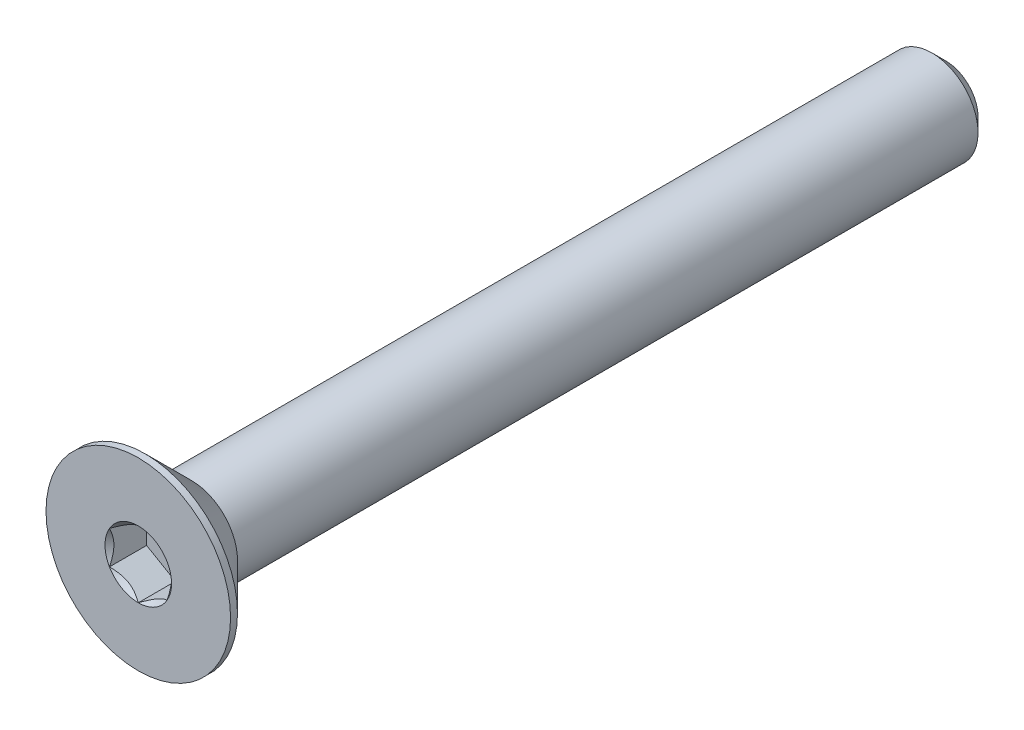
ISO-10303-21;
HEADER;
FILE_DESCRIPTION(('STEP AP214'),'2;1');
FILE_NAME('part.step','',(''),(''),'','','');
FILE_SCHEMA(('AUTOMOTIVE_DESIGN { 1 0 10303 214 1 1 1 1 }'));
ENDSEC;
DATA;
#1=APPLICATION_CONTEXT('core data for automotive mechanical design processes');
#2=APPLICATION_PROTOCOL_DEFINITION('international standard','automotive_design',2000,#1);
#3=PRODUCT_CONTEXT('',#1,'mechanical');
#4=PRODUCT('Part','Part','',(#3));
#5=PRODUCT_RELATED_PRODUCT_CATEGORY('part','',(#4));
#6=PRODUCT_DEFINITION_FORMATION('','',#4);
#7=PRODUCT_DEFINITION_CONTEXT('part definition',#1,'design');
#8=PRODUCT_DEFINITION('design','',#6,#7);
#9=PRODUCT_DEFINITION_SHAPE('','',#8);
#10=(LENGTH_UNIT() NAMED_UNIT(*) SI_UNIT(.MILLI.,.METRE.));
#11=(NAMED_UNIT(*) PLANE_ANGLE_UNIT() SI_UNIT($,.RADIAN.));
#12=(NAMED_UNIT(*) SI_UNIT($,.STERADIAN.) SOLID_ANGLE_UNIT());
#13=UNCERTAINTY_MEASURE_WITH_UNIT(LENGTH_MEASURE(1.E-05),#10,'distance_accuracy_value','');
#14=(GEOMETRIC_REPRESENTATION_CONTEXT(3) GLOBAL_UNCERTAINTY_ASSIGNED_CONTEXT((#13)) GLOBAL_UNIT_ASSIGNED_CONTEXT((#10,
#11,#12)) REPRESENTATION_CONTEXT('',''));
#15=CARTESIAN_POINT('',(0.,0.,0.));
#16=DIRECTION('',(0.,0.,1.));
#17=DIRECTION('',(1.,0.,0.));
#18=AXIS2_PLACEMENT_3D('',#15,#16,#17);
#19=CARTESIAN_POINT('',(0.,0.,-17.5));
#20=DIRECTION('',(0.,0.,-1.));
#21=DIRECTION('',(0.,1.,0.));
#22=AXIS2_PLACEMENT_3D('',#19,#20,#21);
#23=CYLINDRICAL_SURFACE('',#22,2.);
#24=CARTESIAN_POINT('',(0.,0.,15.2));
#25=DIRECTION('',(0.,0.,-1.));
#26=DIRECTION('',(0.,1.,0.));
#27=AXIS2_PLACEMENT_3D('',#24,#25,#26);
#28=CIRCLE('',#27,2.);
#29=CARTESIAN_POINT('',(0.,2.,15.2));
#30=VERTEX_POINT('',#29);
#31=EDGE_CURVE('E11',#30,#30,#28,.F.);
#32=ORIENTED_EDGE('',*,*,#31,.F.);
#33=EDGE_LOOP('',(#32));
#34=FACE_BOUND('',#33,.T.);
#35=CARTESIAN_POINT('',(0.,0.,-16.9));
#36=DIRECTION('',(0.,0.,-1.));
#37=DIRECTION('',(0.,1.,0.));
#38=AXIS2_PLACEMENT_3D('',#35,#36,#37);
#39=CIRCLE('',#38,2.);
#40=CARTESIAN_POINT('',(0.,2.,-16.9));
#41=VERTEX_POINT('',#40);
#42=EDGE_CURVE('E45',#41,#41,#39,.F.);
#43=ORIENTED_EDGE('',*,*,#42,.T.);
#44=EDGE_LOOP('',(#43));
#45=FACE_BOUND('',#44,.T.);
#46=ADVANCED_FACE('F37',(#34,#45),#23,.T.);
#47=CARTESIAN_POINT('',(0.,2.,-17.5));
#48=DIRECTION('',(0.,0.,-1.));
#49=DIRECTION('',(0.,1.,0.));
#50=AXIS2_PLACEMENT_3D('',#47,#48,#49);
#51=PLANE('',#50);
#52=CARTESIAN_POINT('',(0.,0.,-17.5));
#53=DIRECTION('',(0.,0.,-1.));
#54=DIRECTION('',(0.,1.,0.));
#55=AXIS2_PLACEMENT_3D('',#52,#53,#54);
#56=CIRCLE('',#55,1.40000000000001);
#57=CARTESIAN_POINT('',(0.,1.40000000000001,-17.5));
#58=VERTEX_POINT('',#57);
#59=EDGE_CURVE('E149',#58,#58,#56,.T.);
#60=ORIENTED_EDGE('',*,*,#59,.T.);
#61=EDGE_LOOP('',(#60));
#62=FACE_BOUND('',#61,.T.);
#63=ADVANCED_FACE('F158',(#62),#51,.T.);
#64=CARTESIAN_POINT('',(0.,0.,-17.5));
#65=DIRECTION('',(0.,0.,1.));
#66=DIRECTION('',(0.,-1.,0.));
#67=AXIS2_PLACEMENT_3D('',#64,#65,#66);
#68=CONICAL_SURFACE('',#67,1.40000000000001,0.785398163397446);
#69=ORIENTED_EDGE('',*,*,#42,.F.);
#70=EDGE_LOOP('',(#69));
#71=FACE_BOUND('',#70,.T.);
#72=ORIENTED_EDGE('',*,*,#59,.F.);
#73=EDGE_LOOP('',(#72));
#74=FACE_BOUND('',#73,.T.);
#75=ADVANCED_FACE('F39',(#71,#74),#68,.T.);
#76=CARTESIAN_POINT('',(0.,0.,-17.5));
#77=DIRECTION('',(0.,0.,-1.));
#78=DIRECTION('',(0.,1.,0.));
#79=AXIS2_PLACEMENT_3D('',#76,#77,#78);
#80=CYLINDRICAL_SURFACE('',#79,4.);
#81=CARTESIAN_POINT('',(0.,0.,17.5));
#82=DIRECTION('',(0.,0.,-1.));
#83=DIRECTION('',(0.,1.,0.));
#84=AXIS2_PLACEMENT_3D('',#81,#82,#83);
#85=CIRCLE('',#84,4.);
#86=CARTESIAN_POINT('',(0.,4.,17.5));
#87=VERTEX_POINT('',#86);
#88=EDGE_CURVE('E129',#87,#87,#85,.T.);
#89=ORIENTED_EDGE('',*,*,#88,.T.);
#90=EDGE_LOOP('',(#89));
#91=FACE_BOUND('',#90,.T.);
#92=CARTESIAN_POINT('',(0.,0.,17.2));
#93=DIRECTION('',(0.,0.,-1.));
#94=DIRECTION('',(0.,1.,0.));
#95=AXIS2_PLACEMENT_3D('',#92,#93,#94);
#96=CIRCLE('',#95,4.);
#97=CARTESIAN_POINT('',(0.,4.,17.2));
#98=VERTEX_POINT('',#97);
#99=EDGE_CURVE('E126',#98,#98,#96,.T.);
#100=ORIENTED_EDGE('',*,*,#99,.F.);
#101=EDGE_LOOP('',(#100));
#102=FACE_BOUND('',#101,.T.);
#103=ADVANCED_FACE('F157',(#91,#102),#80,.T.);
#104=CARTESIAN_POINT('',(0.,0.,15.2));
#105=DIRECTION('',(0.,0.,1.));
#106=DIRECTION('',(0.,-1.,0.));
#107=AXIS2_PLACEMENT_3D('',#104,#105,#106);
#108=CONICAL_SURFACE('',#107,2.,0.785398163397451);
#109=ORIENTED_EDGE('',*,*,#99,.T.);
#110=EDGE_LOOP('',(#109));
#111=FACE_BOUND('',#110,.T.);
#112=ORIENTED_EDGE('',*,*,#31,.T.);
#113=EDGE_LOOP('',(#112));
#114=FACE_BOUND('',#113,.T.);
#115=ADVANCED_FACE('F171',(#111,#114),#108,.T.);
#116=CARTESIAN_POINT('',(0.,0.,17.5));
#117=DIRECTION('',(0.,0.,1.));
#118=DIRECTION('',(0.,-1.,0.));
#119=AXIS2_PLACEMENT_3D('',#116,#117,#118);
#120=PLANE('',#119);
#121=CARTESIAN_POINT('',(0.,0.,17.5));
#122=DIRECTION('',(0.,0.,1.));
#123=DIRECTION('',(1.,0.,0.));
#124=AXIS2_PLACEMENT_3D('',#121,#122,#123);
#125=CIRCLE('',#124,1.44337567297406);
#126=CARTESIAN_POINT('',(1.25,0.721687836487035,17.5));
#127=VERTEX_POINT('',#126);
#128=CARTESIAN_POINT('',(0.,1.44337567297407,17.5));
#129=VERTEX_POINT('',#128);
#130=EDGE_CURVE('E96',#127,#129,#125,.T.);
#131=ORIENTED_EDGE('',*,*,#130,.F.);
#132=CARTESIAN_POINT('',(0.,0.,17.5));
#133=DIRECTION('',(0.,0.,1.));
#134=DIRECTION('',(1.,0.,0.));
#135=AXIS2_PLACEMENT_3D('',#132,#133,#134);
#136=CIRCLE('',#135,1.44337567297406);
#137=CARTESIAN_POINT('',(1.24999999999999,-0.721687836487039,17.5));
#138=VERTEX_POINT('',#137);
#139=EDGE_CURVE('E108',#138,#127,#136,.T.);
#140=ORIENTED_EDGE('',*,*,#139,.F.);
#141=CARTESIAN_POINT('',(0.,0.,17.5));
#142=DIRECTION('',(0.,0.,1.));
#143=DIRECTION('',(1.,0.,0.));
#144=AXIS2_PLACEMENT_3D('',#141,#142,#143);
#145=CIRCLE('',#144,1.44337567297406);
#146=CARTESIAN_POINT('',(0.,-1.44337567297406,17.5));
#147=VERTEX_POINT('',#146);
#148=EDGE_CURVE('E242',#147,#138,#145,.T.);
#149=ORIENTED_EDGE('',*,*,#148,.F.);
#150=CARTESIAN_POINT('',(0.,0.,17.5));
#151=DIRECTION('',(0.,0.,1.));
#152=DIRECTION('',(1.,0.,0.));
#153=AXIS2_PLACEMENT_3D('',#150,#151,#152);
#154=CIRCLE('',#153,1.44337567297406);
#155=CARTESIAN_POINT('',(-1.25,-0.72168783648702,17.5));
#156=VERTEX_POINT('',#155);
#157=EDGE_CURVE('E121',#156,#147,#154,.T.);
#158=ORIENTED_EDGE('',*,*,#157,.F.);
#159=CARTESIAN_POINT('',(0.,0.,17.5));
#160=DIRECTION('',(0.,0.,1.));
#161=DIRECTION('',(1.,0.,0.));
#162=AXIS2_PLACEMENT_3D('',#159,#160,#161);
#163=CIRCLE('',#162,1.44337567297406);
#164=CARTESIAN_POINT('',(-1.25,0.721687836487032,17.5));
#165=VERTEX_POINT('',#164);
#166=EDGE_CURVE('E243',#165,#156,#163,.T.);
#167=ORIENTED_EDGE('',*,*,#166,.F.);
#168=CARTESIAN_POINT('',(0.,0.,17.5));
#169=DIRECTION('',(0.,0.,1.));
#170=DIRECTION('',(1.,0.,0.));
#171=AXIS2_PLACEMENT_3D('',#168,#169,#170);
#172=CIRCLE('',#171,1.44337567297406);
#173=EDGE_CURVE('E111',#129,#165,#172,.T.);
#174=ORIENTED_EDGE('',*,*,#173,.F.);
#175=EDGE_LOOP('',(#131,#140,#149,#158,#167,#174));
#176=FACE_BOUND('',#175,.T.);
#177=ORIENTED_EDGE('',*,*,#88,.F.);
#178=EDGE_LOOP('',(#177));
#179=FACE_BOUND('',#178,.T.);
#180=ADVANCED_FACE('F105',(#176,#179),#120,.T.);
#181=CARTESIAN_POINT('',(1.25,0.721687836487033,15.89));
#182=DIRECTION('',(0.5,0.866025403784439,0.));
#183=DIRECTION('',(-0.866025403784439,0.5,0.));
#184=AXIS2_PLACEMENT_3D('',#181,#182,#183);
#185=PLANE('',#184);
#186=DIRECTION('',(0.,0.,1.));
#187=VECTOR('',#186,1.);
#188=CARTESIAN_POINT('',(1.25,0.721687836487033,15.89));
#189=LINE('',#188,#187);
#190=CARTESIAN_POINT('',(1.25,0.721687836487033,15.89));
#191=VERTEX_POINT('',#190);
#192=EDGE_CURVE('E52',#191,#127,#189,.T.);
#193=ORIENTED_EDGE('',*,*,#192,.T.);
#194=CARTESIAN_POINT('',(-0.000200000000000177,1.4434911430279,17.5001154839091));
#195=CARTESIAN_POINT('',(0.0427751670715862,1.41867941875065,17.4753216680551));
#196=CARTESIAN_POINT('',(0.0864690047459467,1.39345276980743,17.4519837344187));
#197=CARTESIAN_POINT('',(0.175565930841939,1.34201263554194,17.4092520040845));
#198=CARTESIAN_POINT('',(0.220977498357061,1.31579425481277,17.3898819923604));
#199=CARTESIAN_POINT('',(0.312547820935256,1.26292610442246,17.3567004834135));
#200=CARTESIAN_POINT('',(0.358683240175881,1.23628980770471,17.3428055590527));
#201=CARTESIAN_POINT('',(0.451970080407587,1.18243062538509,17.3213972821606));
#202=CARTESIAN_POINT('',(0.499118649136374,1.15520938653762,17.3138679415668));
#203=CARTESIAN_POINT('',(0.580373556887245,1.10829684367467,17.3070744980507));
#204=CARTESIAN_POINT('',(0.614374876627934,1.08866617256958,17.3060685591044));
#205=CARTESIAN_POINT('',(0.68231776443247,1.04943932800611,17.3077614149113));
#206=CARTESIAN_POINT('',(0.71625931765565,1.029843163116,17.3104610272155));
#207=CARTESIAN_POINT('',(0.783814856457491,0.990839954603505,17.3194089303164));
#208=CARTESIAN_POINT('',(0.817428507286766,0.971433104248777,17.3256605258997));
#209=CARTESIAN_POINT('',(0.884094638217804,0.932943395609911,17.3413756814139));
#210=CARTESIAN_POINT('',(0.917146871030287,0.913860680098306,17.3508406200875));
#211=CARTESIAN_POINT('',(1.00179969160026,0.864986351354573,17.3789313906876));
#212=CARTESIAN_POINT('',(1.05286649242963,0.83550292014908,17.3996701574522));
#213=CARTESIAN_POINT('',(1.15300085411325,0.777690319475911,17.4463871346715));
#214=CARTESIAN_POINT('',(1.20207431157827,0.749357745598419,17.4723482959468));
#215=CARTESIAN_POINT('',(1.2502,0.721572366433195,17.5001154839091));
#216=B_SPLINE_CURVE_WITH_KNOTS('',3,(#194,#195,#196,#197,#198,#199,#200,#201,#202,#203,#204,
#205,#206,#207,#208,#209,#210,#211,#212,#213,#214,#215),.UNSPECIFIED.,.F.,.F.,(4,2,2,2,2,2,2,2,
2,2,4),(0.,0.166533409618302,0.334037607289759,0.498880396489693,0.663307919240267,
0.780963963458819,0.898645970148444,1.01643764860772,1.13427993171548,1.3214865203214,
1.50809158792574),.UNSPECIFIED.);
#217=EDGE_CURVE('E93',#129,#127,#216,.T.);
#218=ORIENTED_EDGE('',*,*,#217,.F.);
#219=DIRECTION('',(0.,0.,1.));
#220=VECTOR('',#219,1.);
#221=CARTESIAN_POINT('',(0.,1.44337567297406,15.89));
#222=LINE('',#221,#220);
#223=CARTESIAN_POINT('',(0.,1.44337567297406,15.89));
#224=VERTEX_POINT('',#223);
#225=EDGE_CURVE('E145',#224,#129,#222,.T.);
#226=ORIENTED_EDGE('',*,*,#225,.F.);
#227=DIRECTION('',(-0.866025403784439,0.5,0.));
#228=VECTOR('',#227,1.);
#229=CARTESIAN_POINT('',(1.25,0.721687836487033,15.89));
#230=LINE('',#229,#228);
#231=EDGE_CURVE('E118',#191,#224,#230,.T.);
#232=ORIENTED_EDGE('',*,*,#231,.F.);
#233=EDGE_LOOP('',(#193,#218,#226,#232));
#234=FACE_BOUND('',#233,.T.);
#235=ADVANCED_FACE('F123',(#234),#185,.F.);
#236=CARTESIAN_POINT('',(1.25,-0.721687836487033,15.89));
#237=DIRECTION('',(1.,0.,0.));
#238=DIRECTION('',(0.,1.,0.));
#239=AXIS2_PLACEMENT_3D('',#236,#237,#238);
#240=PLANE('',#239);
#241=DIRECTION('',(0.,0.,1.));
#242=VECTOR('',#241,1.);
#243=CARTESIAN_POINT('',(1.25,-0.721687836487033,15.89));
#244=LINE('',#243,#242);
#245=CARTESIAN_POINT('',(1.25,-0.721687836487033,15.89));
#246=VERTEX_POINT('',#245);
#247=EDGE_CURVE('E60',#246,#138,#244,.T.);
#248=ORIENTED_EDGE('',*,*,#247,.T.);
#249=CARTESIAN_POINT('',(1.25,-1.43934010808078,17.9629820968923));
#250=CARTESIAN_POINT('',(1.25,-1.40429313005659,17.9365249226329));
#251=CARTESIAN_POINT('',(1.25,-1.369050871356,17.9103271603543));
#252=CARTESIAN_POINT('',(1.25,-1.29809650706311,17.8585575718396));
#253=CARTESIAN_POINT('',(1.25,-1.26238428576496,17.8329859043563));
#254=CARTESIAN_POINT('',(1.25,-1.15390111792708,17.7570059936895));
#255=CARTESIAN_POINT('',(1.25,-1.08031646726265,17.7077402861896));
#256=CARTESIAN_POINT('',(1.25,-0.926012322755098,17.6110258302631));
#257=CARTESIAN_POINT('',(1.25,-0.84512531865615,17.5638412989418));
#258=CARTESIAN_POINT('',(1.25,-0.679311174076605,17.4775307343904));
#259=CARTESIAN_POINT('',(1.25,-0.594398891026688,17.4383775346269));
#260=CARTESIAN_POINT('',(1.25,-0.466944812460739,17.3904772236883));
#261=CARTESIAN_POINT('',(1.25,-0.426289985812821,17.3767294897863));
#262=CARTESIAN_POINT('',(1.25,-0.343998850091266,17.3524979274505));
#263=CARTESIAN_POINT('',(1.25,-0.30236247361496,17.3420143238698));
#264=CARTESIAN_POINT('',(1.25,-0.219052696285662,17.3250301617483));
#265=CARTESIAN_POINT('',(1.25,-0.177393428474496,17.3184613604714));
#266=CARTESIAN_POINT('',(1.25,-0.0936293693401864,17.3094350534578));
#267=CARTESIAN_POINT('',(1.25,-0.0515246558543897,17.3069768409973));
#268=CARTESIAN_POINT('',(1.25,0.0311890576306386,17.3063540620133));
#269=CARTESIAN_POINT('',(1.25,0.0717969625499375,17.3080371168463));
#270=CARTESIAN_POINT('',(1.25,0.152668636885204,17.3152682705979));
#271=CARTESIAN_POINT('',(1.25,0.192932338835365,17.3208171104131));
#272=CARTESIAN_POINT('',(1.25,0.273499879165302,17.335571036465));
#273=CARTESIAN_POINT('',(1.25,0.313792180618518,17.3448381759641));
#274=CARTESIAN_POINT('',(1.25,0.393496413911464,17.3665361784574));
#275=CARTESIAN_POINT('',(1.25,0.432908419115066,17.3789667767306));
#276=CARTESIAN_POINT('',(1.25,0.556992735862305,17.4227793529314));
#277=CARTESIAN_POINT('',(1.25,0.639898924666093,17.459151072876));
#278=CARTESIAN_POINT('',(1.25,0.80181655549971,17.5400191621783));
#279=CARTESIAN_POINT('',(1.25,0.880812666325053,17.584544720912));
#280=CARTESIAN_POINT('',(1.25,1.03178561279751,17.6764048766666));
#281=CARTESIAN_POINT('',(1.25,1.10391618485086,17.7234899339163));
#282=CARTESIAN_POINT('',(1.25,1.21018606043311,17.7962785615985));
#283=CARTESIAN_POINT('',(1.25,1.2451506996938,17.8207980853934));
#284=CARTESIAN_POINT('',(1.25,1.31460220852737,17.8704856367657));
#285=CARTESIAN_POINT('',(1.25,1.34908920596619,17.8956534854155));
#286=CARTESIAN_POINT('',(1.25,1.38337731682912,17.9210901488412));
#287=B_SPLINE_CURVE_WITH_KNOTS('',3,(#249,#250,#251,#252,#253,#254,#255,#256,#257,#258,#259,
#260,#261,#262,#263,#264,#265,#266,#267,#268,#269,#270,#271,#272,#273,#274,#275,#276,#277,#278,
#279,#280,#281,#282,#283,#284,#285,#286),.UNSPECIFIED.,.F.,.F.,(4,2,2,2,2,2,2,2,2,2,2,2,2,2,2,2,
2,2,4),(0.,0.131732960381449,0.263498984161648,0.529042014455828,0.809741926134624,
1.08947609717226,1.21811634272578,1.34676544783902,1.47310084517845,1.59941451973786,
1.72115042167851,1.84290966131736,1.96679153905343,2.09066305366041,2.36146692896011,
2.63325989198493,2.89154668212281,3.01965734507715,3.1477330224563),.UNSPECIFIED.);
#288=EDGE_CURVE('E117',#127,#138,#287,.F.);
#289=ORIENTED_EDGE('',*,*,#288,.F.);
#290=ORIENTED_EDGE('',*,*,#192,.F.);
#291=DIRECTION('',(0.,1.,0.));
#292=VECTOR('',#291,1.);
#293=CARTESIAN_POINT('',(1.25,-0.721687836487033,15.89));
#294=LINE('',#293,#292);
#295=EDGE_CURVE('E134',#246,#191,#294,.T.);
#296=ORIENTED_EDGE('',*,*,#295,.F.);
#297=EDGE_LOOP('',(#248,#289,#290,#296));
#298=FACE_BOUND('',#297,.T.);
#299=ADVANCED_FACE('F120',(#298),#240,.F.);
#300=CARTESIAN_POINT('',(0.,-1.44337567297406,15.89));
#301=DIRECTION('',(0.5,-0.866025403784439,0.));
#302=DIRECTION('',(0.866025403784439,0.5,0.));
#303=AXIS2_PLACEMENT_3D('',#300,#301,#302);
#304=PLANE('',#303);
#305=DIRECTION('',(0.,0.,1.));
#306=VECTOR('',#305,1.);
#307=CARTESIAN_POINT('',(0.,-1.44337567297406,15.89));
#308=LINE('',#307,#306);
#309=CARTESIAN_POINT('',(0.,-1.44337567297406,15.89));
#310=VERTEX_POINT('',#309);
#311=EDGE_CURVE('E131',#310,#147,#308,.T.);
#312=ORIENTED_EDGE('',*,*,#311,.T.);
#313=CARTESIAN_POINT('',(1.2502,-0.721572366433196,17.5001154839091));
#314=CARTESIAN_POINT('',(1.20722483292841,-0.746384090710445,17.4753216680551));
#315=CARTESIAN_POINT('',(1.16353099525405,-0.771610739653665,17.4519837344187));
#316=CARTESIAN_POINT('',(1.07443406915806,-0.823050873919155,17.4092520040845));
#317=CARTESIAN_POINT('',(1.02902250164294,-0.849269254648333,17.3898819923604));
#318=CARTESIAN_POINT('',(0.937452179064743,-0.902137405038635,17.3567004834135));
#319=CARTESIAN_POINT('',(0.891316759824117,-0.928773701756386,17.3428055590527));
#320=CARTESIAN_POINT('',(0.798029919592411,-0.982632884076011,17.3213972821606));
#321=CARTESIAN_POINT('',(0.750881350863624,-1.00985412292348,17.3138679415668));
#322=CARTESIAN_POINT('',(0.669626443112752,-1.05676666578643,17.3070744980507));
#323=CARTESIAN_POINT('',(0.635625123372063,-1.07639733689152,17.3060685591044));
#324=CARTESIAN_POINT('',(0.567682235567526,-1.11562418145499,17.3077614149113));
#325=CARTESIAN_POINT('',(0.533740682344346,-1.1352203463451,17.3104610272155));
#326=CARTESIAN_POINT('',(0.466185143542504,-1.1742235548576,17.3194089303164));
#327=CARTESIAN_POINT('',(0.432571492713228,-1.19363040521232,17.3256605258997));
#328=CARTESIAN_POINT('',(0.36590536178219,-1.23212011385119,17.3413756814139));
#329=CARTESIAN_POINT('',(0.332853128969707,-1.2512028293628,17.3508406200875));
#330=CARTESIAN_POINT('',(0.248200308399738,-1.30007715810653,17.3789313906876));
#331=CARTESIAN_POINT('',(0.197133507570363,-1.32956058931202,17.3996701574522));
#332=CARTESIAN_POINT('',(0.0969991458867458,-1.38737318998519,17.4463871346715));
#333=CARTESIAN_POINT('',(0.0479256884217306,-1.41570576386268,17.4723482959468));
#334=CARTESIAN_POINT('',(-0.000200000000001061,-1.4434911430279,17.5001154839091));
#335=B_SPLINE_CURVE_WITH_KNOTS('',3,(#313,#314,#315,#316,#317,#318,#319,#320,#321,#322,#323,
#324,#325,#326,#327,#328,#329,#330,#331,#332,#333,#334),.UNSPECIFIED.,.F.,.F.,(4,2,2,2,2,2,2,2,
2,2,4),(0.,0.1665334096183,0.334037607289757,0.498880396489692,0.663307919240267,
0.780963963458819,0.898645970148446,1.01643764860773,1.13427993171549,1.3214865203214,
1.50809158792573),.UNSPECIFIED.);
#336=EDGE_CURVE('E240',#138,#147,#335,.T.);
#337=ORIENTED_EDGE('',*,*,#336,.F.);
#338=ORIENTED_EDGE('',*,*,#247,.F.);
#339=DIRECTION('',(0.866025403784439,0.5,0.));
#340=VECTOR('',#339,1.);
#341=CARTESIAN_POINT('',(0.,-1.44337567297406,15.89));
#342=LINE('',#341,#340);
#343=EDGE_CURVE('E232',#310,#246,#342,.T.);
#344=ORIENTED_EDGE('',*,*,#343,.F.);
#345=EDGE_LOOP('',(#312,#337,#338,#344));
#346=FACE_BOUND('',#345,.T.);
#347=ADVANCED_FACE('F197',(#346),#304,.F.);
#348=CARTESIAN_POINT('',(-1.25,-0.721687836487032,15.89));
#349=DIRECTION('',(-0.5,-0.866025403784438,0.));
#350=DIRECTION('',(0.866025403784439,-0.5,0.));
#351=AXIS2_PLACEMENT_3D('',#348,#349,#350);
#352=PLANE('',#351);
#353=DIRECTION('',(0.,0.,1.));
#354=VECTOR('',#353,1.);
#355=CARTESIAN_POINT('',(-1.25,-0.721687836487032,15.89));
#356=LINE('',#355,#354);
#357=CARTESIAN_POINT('',(-1.25,-0.721687836487032,15.89));
#358=VERTEX_POINT('',#357);
#359=EDGE_CURVE('E139',#358,#156,#356,.T.);
#360=ORIENTED_EDGE('',*,*,#359,.T.);
#361=CARTESIAN_POINT('',(0.000200000000000554,-1.4434911430279,17.5001154839091));
#362=CARTESIAN_POINT('',(-0.0427751670715863,-1.41867941875065,17.4753216680551));
#363=CARTESIAN_POINT('',(-0.0864690047459477,-1.39345276980743,17.4519837344187));
#364=CARTESIAN_POINT('',(-0.175565930841942,-1.34201263554194,17.4092520040845));
#365=CARTESIAN_POINT('',(-0.220977498357064,-1.31579425481276,17.3898819923604));
#366=CARTESIAN_POINT('',(-0.31254782093526,-1.26292610442246,17.3567004834135));
#367=CARTESIAN_POINT('',(-0.358683240175886,-1.23628980770471,17.3428055590527));
#368=CARTESIAN_POINT('',(-0.451970080407593,-1.18243062538508,17.3213972821606));
#369=CARTESIAN_POINT('',(-0.499118649136381,-1.15520938653761,17.3138679415668));
#370=CARTESIAN_POINT('',(-0.580373556887255,-1.10829684367467,17.3070744980507));
#371=CARTESIAN_POINT('',(-0.614374876627944,-1.08866617256958,17.3060685591044));
#372=CARTESIAN_POINT('',(-0.682317764432481,-1.04943932800611,17.3077614149113));
#373=CARTESIAN_POINT('',(-0.716259317655661,-1.02984316311599,17.3104610272155));
#374=CARTESIAN_POINT('',(-0.783814856457503,-0.990839954603497,17.3194089303164));
#375=CARTESIAN_POINT('',(-0.817428507286779,-0.971433104248769,17.3256605258997));
#376=CARTESIAN_POINT('',(-0.884094638217817,-0.932943395609903,17.3413756814139));
#377=CARTESIAN_POINT('',(-0.9171468710303,-0.913860680098298,17.3508406200875));
#378=CARTESIAN_POINT('',(-1.00179969160027,-0.864986351354566,17.3789313906876));
#379=CARTESIAN_POINT('',(-1.05286649242964,-0.835502920149074,17.3996701574522));
#380=CARTESIAN_POINT('',(-1.15300085411326,-0.777690319475908,17.4463871346715));
#381=CARTESIAN_POINT('',(-1.20207431157827,-0.749357745598416,17.4723482959468));
#382=CARTESIAN_POINT('',(-1.2502,-0.721572366433195,17.5001154839091));
#383=B_SPLINE_CURVE_WITH_KNOTS('',3,(#361,#362,#363,#364,#365,#366,#367,#368,#369,#370,#371,
#372,#373,#374,#375,#376,#377,#378,#379,#380,#381,#382),.UNSPECIFIED.,.F.,.F.,(4,2,2,2,2,2,2,2,
2,2,4),(0.,0.166533409618304,0.334037607289763,0.4988803964897,0.663307919240278,
0.780963963458831,0.898645970148458,1.01643764860774,1.1342799317155,1.32148652032141,
1.50809158792574),.UNSPECIFIED.);
#384=EDGE_CURVE('E214',#147,#156,#383,.T.);
#385=ORIENTED_EDGE('',*,*,#384,.F.);
#386=ORIENTED_EDGE('',*,*,#311,.F.);
#387=DIRECTION('',(0.866025403784438,-0.5,0.));
#388=VECTOR('',#387,1.);
#389=CARTESIAN_POINT('',(-1.25,-0.721687836487032,15.89));
#390=LINE('',#389,#388);
#391=EDGE_CURVE('E230',#358,#310,#390,.T.);
#392=ORIENTED_EDGE('',*,*,#391,.F.);
#393=EDGE_LOOP('',(#360,#385,#386,#392));
#394=FACE_BOUND('',#393,.T.);
#395=ADVANCED_FACE('F193',(#394),#352,.F.);
#396=CARTESIAN_POINT('',(-1.25,0.721687836487033,15.89));
#397=DIRECTION('',(-1.,0.,0.));
#398=DIRECTION('',(0.,0.,1.));
#399=AXIS2_PLACEMENT_3D('',#396,#397,#398);
#400=PLANE('',#399);
#401=DIRECTION('',(0.,0.,1.));
#402=VECTOR('',#401,1.);
#403=CARTESIAN_POINT('',(-1.25,0.721687836487033,15.89));
#404=LINE('',#403,#402);
#405=CARTESIAN_POINT('',(-1.25,0.721687836487033,15.89));
#406=VERTEX_POINT('',#405);
#407=EDGE_CURVE('E142',#406,#165,#404,.T.);
#408=ORIENTED_EDGE('',*,*,#407,.T.);
#409=CARTESIAN_POINT('',(-1.25,-1.43934010808078,17.9629820968923));
#410=CARTESIAN_POINT('',(-1.25,-1.40429313005659,17.9365249226329));
#411=CARTESIAN_POINT('',(-1.25,-1.369050871356,17.9103271603543));
#412=CARTESIAN_POINT('',(-1.25,-1.29809650706311,17.8585575718396));
#413=CARTESIAN_POINT('',(-1.25,-1.26238428576496,17.8329859043563));
#414=CARTESIAN_POINT('',(-1.25,-1.15390111792708,17.7570059936895));
#415=CARTESIAN_POINT('',(-1.25,-1.08031646726265,17.7077402861896));
#416=CARTESIAN_POINT('',(-1.25,-0.926012322755097,17.6110258302631));
#417=CARTESIAN_POINT('',(-1.25,-0.845125318656149,17.5638412989418));
#418=CARTESIAN_POINT('',(-1.25,-0.679311174076604,17.4775307343904));
#419=CARTESIAN_POINT('',(-1.25,-0.594398891026688,17.4383775346269));
#420=CARTESIAN_POINT('',(-1.25,-0.46694481246074,17.3904772236883));
#421=CARTESIAN_POINT('',(-1.25,-0.426289985812822,17.3767294897863));
#422=CARTESIAN_POINT('',(-1.25,-0.343998850091267,17.3524979274505));
#423=CARTESIAN_POINT('',(-1.25,-0.302362473614961,17.3420143238698));
#424=CARTESIAN_POINT('',(-1.25,-0.219052696285664,17.3250301617483));
#425=CARTESIAN_POINT('',(-1.25,-0.177393428474498,17.3184613604714));
#426=CARTESIAN_POINT('',(-1.25,-0.0936293693401893,17.3094350534578));
#427=CARTESIAN_POINT('',(-1.25,-0.0515246558543927,17.3069768409973));
#428=CARTESIAN_POINT('',(-1.25,0.0311890576306357,17.3063540620133));
#429=CARTESIAN_POINT('',(-1.25,0.0717969625499349,17.3080371168463));
#430=CARTESIAN_POINT('',(-1.25,0.152668636885202,17.3152682705979));
#431=CARTESIAN_POINT('',(-1.25,0.192932338835363,17.3208171104131));
#432=CARTESIAN_POINT('',(-1.25,0.273499879165301,17.335571036465));
#433=CARTESIAN_POINT('',(-1.25,0.313792180618517,17.3448381759641));
#434=CARTESIAN_POINT('',(-1.25,0.393496413911464,17.3665361784573));
#435=CARTESIAN_POINT('',(-1.25,0.432908419115066,17.3789667767306));
#436=CARTESIAN_POINT('',(-1.25,0.556992735862305,17.4227793529314));
#437=CARTESIAN_POINT('',(-1.25,0.639898924666092,17.459151072876));
#438=CARTESIAN_POINT('',(-1.25,0.801816555499708,17.5400191621783));
#439=CARTESIAN_POINT('',(-1.25,0.880812666325052,17.584544720912));
#440=CARTESIAN_POINT('',(-1.25,1.03178561279751,17.6764048766666));
#441=CARTESIAN_POINT('',(-1.25,1.10391618485086,17.7234899339163));
#442=CARTESIAN_POINT('',(-1.25,1.21018606043311,17.7962785615985));
#443=CARTESIAN_POINT('',(-1.25,1.2451506996938,17.8207980853934));
#444=CARTESIAN_POINT('',(-1.25,1.31460220852737,17.8704856367657));
#445=CARTESIAN_POINT('',(-1.25,1.34908920596619,17.8956534854155));
#446=CARTESIAN_POINT('',(-1.25,1.38337731682912,17.9210901488412));
#447=B_SPLINE_CURVE_WITH_KNOTS('',3,(#409,#410,#411,#412,#413,#414,#415,#416,#417,#418,#419,
#420,#421,#422,#423,#424,#425,#426,#427,#428,#429,#430,#431,#432,#433,#434,#435,#436,#437,#438,
#439,#440,#441,#442,#443,#444,#445,#446),.UNSPECIFIED.,.F.,.F.,(4,2,2,2,2,2,2,2,2,2,2,2,2,2,2,2,
2,2,4),(0.,0.131732960381447,0.263498984161644,0.529042014455828,0.809741926134625,
1.08947609717226,1.21811634272577,1.34676544783901,1.47310084517845,1.59941451973786,
1.72115042167851,1.84290966131736,1.96679153905343,2.09066305366041,2.36146692896011,
2.63325989198493,2.89154668212281,3.01965734507714,3.1477330224563),.UNSPECIFIED.);
#448=EDGE_CURVE('E99',#156,#165,#447,.T.);
#449=ORIENTED_EDGE('',*,*,#448,.F.);
#450=ORIENTED_EDGE('',*,*,#359,.F.);
#451=DIRECTION('',(0.,-1.,0.));
#452=VECTOR('',#451,1.);
#453=CARTESIAN_POINT('',(-1.25,0.721687836487033,15.89));
#454=LINE('',#453,#452);
#455=EDGE_CURVE('E227',#406,#358,#454,.T.);
#456=ORIENTED_EDGE('',*,*,#455,.F.);
#457=EDGE_LOOP('',(#408,#449,#450,#456));
#458=FACE_BOUND('',#457,.T.);
#459=ADVANCED_FACE('F189',(#458),#400,.F.);
#460=CARTESIAN_POINT('',(0.,1.44337567297406,15.89));
#461=DIRECTION('',(-0.5,0.866025403784439,0.));
#462=DIRECTION('',(-0.866025403784439,-0.5,0.));
#463=AXIS2_PLACEMENT_3D('',#460,#461,#462);
#464=PLANE('',#463);
#465=ORIENTED_EDGE('',*,*,#225,.T.);
#466=CARTESIAN_POINT('',(-1.2502,0.721572366433195,17.5001154839091));
#467=CARTESIAN_POINT('',(-1.20722483292841,0.746384090710445,17.4753216680551));
#468=CARTESIAN_POINT('',(-1.16353099525405,0.771610739653665,17.4519837344187));
#469=CARTESIAN_POINT('',(-1.07443406915806,0.823050873919156,17.4092520040845));
#470=CARTESIAN_POINT('',(-1.02902250164293,0.849269254648334,17.3898819923604));
#471=CARTESIAN_POINT('',(-0.937452179064739,0.902137405038637,17.3567004834135));
#472=CARTESIAN_POINT('',(-0.891316759824113,0.928773701756388,17.3428055590527));
#473=CARTESIAN_POINT('',(-0.798029919592406,0.982632884076014,17.3213972821606));
#474=CARTESIAN_POINT('',(-0.750881350863618,1.00985412292348,17.3138679415668));
#475=CARTESIAN_POINT('',(-0.669626443112746,1.05676666578643,17.3070744980507));
#476=CARTESIAN_POINT('',(-0.635625123372057,1.07639733689152,17.3060685591044));
#477=CARTESIAN_POINT('',(-0.567682235567521,1.11562418145499,17.3077614149113));
#478=CARTESIAN_POINT('',(-0.533740682344341,1.1352203463451,17.3104610272155));
#479=CARTESIAN_POINT('',(-0.4661851435425,1.1742235548576,17.3194089303164));
#480=CARTESIAN_POINT('',(-0.432571492713224,1.19363040521233,17.3256605258997));
#481=CARTESIAN_POINT('',(-0.365905361782186,1.23212011385119,17.3413756814139));
#482=CARTESIAN_POINT('',(-0.332853128969704,1.2512028293628,17.3508406200875));
#483=CARTESIAN_POINT('',(-0.248200308399735,1.30007715810653,17.3789313906876));
#484=CARTESIAN_POINT('',(-0.197133507570361,1.32956058931202,17.3996701574522));
#485=CARTESIAN_POINT('',(-0.0969991458867448,1.38737318998519,17.4463871346715));
#486=CARTESIAN_POINT('',(-0.04792568842173,1.41570576386268,17.4723482959468));
#487=CARTESIAN_POINT('',(0.000200000000001334,1.4434911430279,17.5001154839091));
#488=B_SPLINE_CURVE_WITH_KNOTS('',3,(#466,#467,#468,#469,#470,#471,#472,#473,#474,#475,#476,
#477,#478,#479,#480,#481,#482,#483,#484,#485,#486,#487),.UNSPECIFIED.,.F.,.F.,(4,2,2,2,2,2,2,2,
2,2,4),(0.,0.166533409618305,0.334037607289763,0.4988803964897,0.663307919240277,
0.780963963458828,0.898645970148454,1.01643764860773,1.13427993171549,1.32148652032141,
1.50809158792574),.UNSPECIFIED.);
#489=EDGE_CURVE('E236',#165,#129,#488,.T.);
#490=ORIENTED_EDGE('',*,*,#489,.F.);
#491=ORIENTED_EDGE('',*,*,#407,.F.);
#492=DIRECTION('',(-0.866025403784439,-0.5,0.));
#493=VECTOR('',#492,1.);
#494=CARTESIAN_POINT('',(0.,1.44337567297406,15.89));
#495=LINE('',#494,#493);
#496=EDGE_CURVE('E224',#224,#406,#495,.T.);
#497=ORIENTED_EDGE('',*,*,#496,.F.);
#498=EDGE_LOOP('',(#465,#490,#491,#497));
#499=FACE_BOUND('',#498,.T.);
#500=ADVANCED_FACE('F185',(#499),#464,.F.);
#501=CARTESIAN_POINT('',(0.,0.,15.89));
#502=DIRECTION('',(0.,0.,1.));
#503=DIRECTION('',(1.,0.,0.));
#504=AXIS2_PLACEMENT_3D('',#501,#502,#503);
#505=PLANE('',#504);
#506=ORIENTED_EDGE('',*,*,#231,.T.);
#507=ORIENTED_EDGE('',*,*,#496,.T.);
#508=ORIENTED_EDGE('',*,*,#455,.T.);
#509=ORIENTED_EDGE('',*,*,#391,.T.);
#510=ORIENTED_EDGE('',*,*,#343,.T.);
#511=ORIENTED_EDGE('',*,*,#295,.T.);
#512=EDGE_LOOP('',(#506,#507,#508,#509,#510,#511));
#513=FACE_BOUND('',#512,.T.);
#514=ADVANCED_FACE('F188',(#513),#505,.T.);
#515=CARTESIAN_POINT('',(0.,0.,17.5));
#516=DIRECTION('',(0.,0.,1.));
#517=DIRECTION('',(1.,0.,0.));
#518=AXIS2_PLACEMENT_3D('',#515,#516,#517);
#519=CONICAL_SURFACE('',#518,1.44337567297406,0.78539816339745);
#520=ORIENTED_EDGE('',*,*,#489,.T.);
#521=ORIENTED_EDGE('',*,*,#173,.T.);
#522=EDGE_LOOP('',(#520,#521));
#523=FACE_BOUND('',#522,.T.);
#524=ADVANCED_FACE('F204',(#523),#519,.F.);
#525=CARTESIAN_POINT('',(0.,0.,17.5));
#526=DIRECTION('',(0.,0.,1.));
#527=DIRECTION('',(1.,0.,0.));
#528=AXIS2_PLACEMENT_3D('',#525,#526,#527);
#529=CONICAL_SURFACE('',#528,1.44337567297406,0.78539816339745);
#530=ORIENTED_EDGE('',*,*,#384,.T.);
#531=ORIENTED_EDGE('',*,*,#157,.T.);
#532=EDGE_LOOP('',(#530,#531));
#533=FACE_BOUND('',#532,.T.);
#534=ADVANCED_FACE('F206',(#533),#529,.F.);
#535=CARTESIAN_POINT('',(0.,0.,17.5));
#536=DIRECTION('',(0.,0.,1.));
#537=DIRECTION('',(1.,0.,0.));
#538=AXIS2_PLACEMENT_3D('',#535,#536,#537);
#539=CONICAL_SURFACE('',#538,1.44337567297406,0.78539816339745);
#540=ORIENTED_EDGE('',*,*,#288,.T.);
#541=ORIENTED_EDGE('',*,*,#139,.T.);
#542=EDGE_LOOP('',(#540,#541));
#543=FACE_BOUND('',#542,.T.);
#544=ADVANCED_FACE('F116',(#543),#539,.F.);
#545=CARTESIAN_POINT('',(0.,0.,17.5));
#546=DIRECTION('',(0.,0.,1.));
#547=DIRECTION('',(1.,0.,0.));
#548=AXIS2_PLACEMENT_3D('',#545,#546,#547);
#549=CONICAL_SURFACE('',#548,1.44337567297406,0.78539816339745);
#550=ORIENTED_EDGE('',*,*,#336,.T.);
#551=ORIENTED_EDGE('',*,*,#148,.T.);
#552=EDGE_LOOP('',(#550,#551));
#553=FACE_BOUND('',#552,.T.);
#554=ADVANCED_FACE('F255',(#553),#549,.F.);
#555=CARTESIAN_POINT('',(0.,0.,17.5));
#556=DIRECTION('',(0.,0.,1.));
#557=DIRECTION('',(1.,0.,0.));
#558=AXIS2_PLACEMENT_3D('',#555,#556,#557);
#559=CONICAL_SURFACE('',#558,1.44337567297406,0.78539816339745);
#560=ORIENTED_EDGE('',*,*,#448,.T.);
#561=ORIENTED_EDGE('',*,*,#166,.T.);
#562=EDGE_LOOP('',(#560,#561));
#563=FACE_BOUND('',#562,.T.);
#564=ADVANCED_FACE('F260',(#563),#559,.F.);
#565=CARTESIAN_POINT('',(0.,0.,17.5));
#566=DIRECTION('',(0.,0.,1.));
#567=DIRECTION('',(1.,0.,0.));
#568=AXIS2_PLACEMENT_3D('',#565,#566,#567);
#569=CONICAL_SURFACE('',#568,1.44337567297406,0.78539816339745);
#570=ORIENTED_EDGE('',*,*,#217,.T.);
#571=ORIENTED_EDGE('',*,*,#130,.T.);
#572=EDGE_LOOP('',(#570,#571));
#573=FACE_BOUND('',#572,.T.);
#574=ADVANCED_FACE('F95',(#573),#569,.F.);
#575=CLOSED_SHELL('',(#46,#63,#75,#103,#115,#180,#235,#299,#347,#395,#459,#500,#514,#524,#534,
#544,#554,#564,#574));
#576=MANIFOLD_SOLID_BREP('B2',#575);
#577=ADVANCED_BREP_SHAPE_REPRESENTATION('',(#18,#576),#14);
#578=SHAPE_DEFINITION_REPRESENTATION(#9,#577);
ENDSEC;
END-ISO-10303-21;
